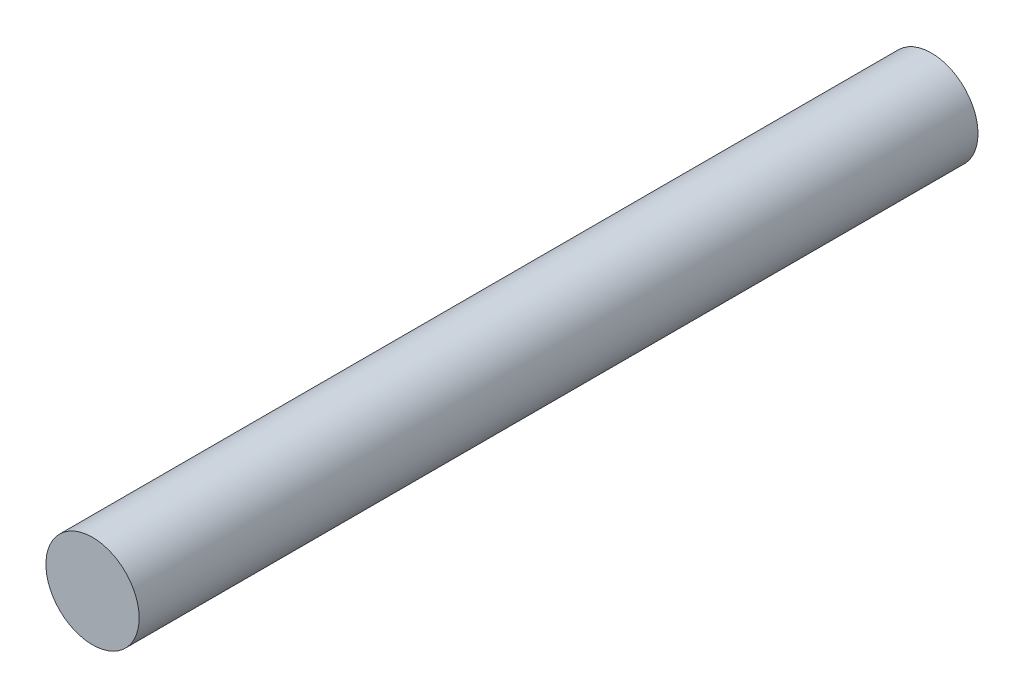
ISO-10303-21;
HEADER;
FILE_DESCRIPTION(('STEP AP214'),'2;1');
FILE_NAME('part.step','',(''),(''),'','','');
FILE_SCHEMA(('AUTOMOTIVE_DESIGN { 1 0 10303 214 1 1 1 1 }'));
ENDSEC;
DATA;
#1=APPLICATION_CONTEXT('core data for automotive mechanical design processes');
#2=APPLICATION_PROTOCOL_DEFINITION('international standard','automotive_design',2000,#1);
#3=PRODUCT_CONTEXT('',#1,'mechanical');
#4=PRODUCT('Part','Part','',(#3));
#5=PRODUCT_RELATED_PRODUCT_CATEGORY('part','',(#4));
#6=PRODUCT_DEFINITION_FORMATION('','',#4);
#7=PRODUCT_DEFINITION_CONTEXT('part definition',#1,'design');
#8=PRODUCT_DEFINITION('design','',#6,#7);
#9=PRODUCT_DEFINITION_SHAPE('','',#8);
#10=(LENGTH_UNIT() NAMED_UNIT(*) SI_UNIT(.MILLI.,.METRE.));
#11=(NAMED_UNIT(*) PLANE_ANGLE_UNIT() SI_UNIT($,.RADIAN.));
#12=(NAMED_UNIT(*) SI_UNIT($,.STERADIAN.) SOLID_ANGLE_UNIT());
#13=UNCERTAINTY_MEASURE_WITH_UNIT(LENGTH_MEASURE(1.E-05),#10,'distance_accuracy_value','');
#14=(GEOMETRIC_REPRESENTATION_CONTEXT(3) GLOBAL_UNCERTAINTY_ASSIGNED_CONTEXT((#13)) GLOBAL_UNIT_ASSIGNED_CONTEXT((#10,
#11,#12)) REPRESENTATION_CONTEXT('',''));
#15=CARTESIAN_POINT('',(0.,0.,0.));
#16=DIRECTION('',(0.,0.,1.));
#17=DIRECTION('',(1.,0.,0.));
#18=AXIS2_PLACEMENT_3D('',#15,#16,#17);
#19=CARTESIAN_POINT('',(-3.374,-4.501,-9.1));
#20=DIRECTION('',(0.,0.,-1.));
#21=DIRECTION('',(-1.,0.,0.));
#22=AXIS2_PLACEMENT_3D('',#19,#20,#21);
#23=PLANE('',#22);
#24=CARTESIAN_POINT('',(-3.675,-4.2,-9.1));
#25=DIRECTION('',(0.,0.,1.));
#26=DIRECTION('',(1.,0.,0.));
#27=AXIS2_PLACEMENT_3D('',#24,#25,#26);
#28=CIRCLE('',#27,0.3);
#29=CARTESIAN_POINT('',(-3.375,-4.2,-9.1));
#30=VERTEX_POINT('',#29);
#31=EDGE_CURVE('E19',#30,#30,#28,.T.);
#32=ORIENTED_EDGE('',*,*,#31,.F.);
#33=EDGE_LOOP('',(#32));
#34=FACE_BOUND('',#33,.T.);
#35=ADVANCED_FACE('F15',(#34),#23,.T.);
#36=CARTESIAN_POINT('',(-3.675,-4.2,-9.1));
#37=DIRECTION('',(0.,0.,1.));
#38=DIRECTION('',(1.,0.,0.));
#39=AXIS2_PLACEMENT_3D('',#36,#37,#38);
#40=CYLINDRICAL_SURFACE('',#39,0.3);
#41=CARTESIAN_POINT('',(-3.675,-4.2,-3.7));
#42=DIRECTION('',(0.,0.,1.));
#43=DIRECTION('',(1.,0.,0.));
#44=AXIS2_PLACEMENT_3D('',#41,#42,#43);
#45=CIRCLE('',#44,0.3);
#46=CARTESIAN_POINT('',(-3.375,-4.2,-3.7));
#47=VERTEX_POINT('',#46);
#48=EDGE_CURVE('E10',#47,#47,#45,.T.);
#49=ORIENTED_EDGE('',*,*,#48,.F.);
#50=EDGE_LOOP('',(#49));
#51=FACE_BOUND('',#50,.T.);
#52=ORIENTED_EDGE('',*,*,#31,.T.);
#53=EDGE_LOOP('',(#52));
#54=FACE_BOUND('',#53,.T.);
#55=ADVANCED_FACE('F28',(#51,#54),#40,.T.);
#56=CARTESIAN_POINT('',(-3.374,-3.899,-3.7));
#57=DIRECTION('',(0.,0.,1.));
#58=DIRECTION('',(-1.,0.,0.));
#59=AXIS2_PLACEMENT_3D('',#56,#57,#58);
#60=PLANE('',#59);
#61=ORIENTED_EDGE('',*,*,#48,.T.);
#62=EDGE_LOOP('',(#61));
#63=FACE_BOUND('',#62,.T.);
#64=ADVANCED_FACE('F17',(#63),#60,.T.);
#65=CLOSED_SHELL('',(#35,#55,#64));
#66=MANIFOLD_SOLID_BREP('B1',#65);
#67=ADVANCED_BREP_SHAPE_REPRESENTATION('',(#18,#66),#14);
#68=SHAPE_DEFINITION_REPRESENTATION(#9,#67);
ENDSEC;
END-ISO-10303-21;
